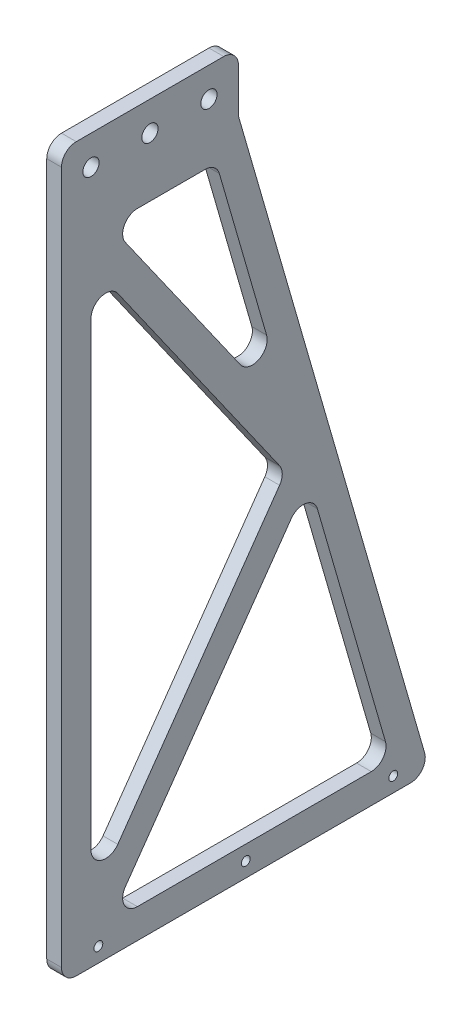
ISO-10303-21;
HEADER;
FILE_DESCRIPTION(('STEP AP214'),'2;1');
FILE_NAME('part.step','',(''),(''),'','','');
FILE_SCHEMA(('AUTOMOTIVE_DESIGN { 1 0 10303 214 1 1 1 1 }'));
ENDSEC;
DATA;
#1=APPLICATION_CONTEXT('core data for automotive mechanical design processes');
#2=APPLICATION_PROTOCOL_DEFINITION('international standard','automotive_design',2000,#1);
#3=PRODUCT_CONTEXT('',#1,'mechanical');
#4=PRODUCT('Part','Part','',(#3));
#5=PRODUCT_RELATED_PRODUCT_CATEGORY('part','',(#4));
#6=PRODUCT_DEFINITION_FORMATION('','',#4);
#7=PRODUCT_DEFINITION_CONTEXT('part definition',#1,'design');
#8=PRODUCT_DEFINITION('design','',#6,#7);
#9=PRODUCT_DEFINITION_SHAPE('','',#8);
#10=(LENGTH_UNIT() NAMED_UNIT(*) SI_UNIT(.MILLI.,.METRE.));
#11=(NAMED_UNIT(*) PLANE_ANGLE_UNIT() SI_UNIT($,.RADIAN.));
#12=(NAMED_UNIT(*) SI_UNIT($,.STERADIAN.) SOLID_ANGLE_UNIT());
#13=UNCERTAINTY_MEASURE_WITH_UNIT(LENGTH_MEASURE(1.E-05),#10,'distance_accuracy_value','');
#14=(GEOMETRIC_REPRESENTATION_CONTEXT(3) GLOBAL_UNCERTAINTY_ASSIGNED_CONTEXT((#13)) GLOBAL_UNIT_ASSIGNED_CONTEXT((#10,
#11,#12)) REPRESENTATION_CONTEXT('',''));
#15=CARTESIAN_POINT('',(0.,0.,0.));
#16=DIRECTION('',(0.,0.,1.));
#17=DIRECTION('',(1.,0.,0.));
#18=AXIS2_PLACEMENT_3D('',#15,#16,#17);
#19=CARTESIAN_POINT('',(5.,7.22880583409299,-25.0227894257065));
#20=DIRECTION('',(0.,0.277539652820775,-0.960714182841142));
#21=DIRECTION('',(0.,0.960714182841142,0.277539652820775));
#22=AXIS2_PLACEMENT_3D('',#19,#20,#21);
#23=PLANE('',#22);
#24=DIRECTION('',(0.,-0.960714182841142,-0.277539652820775));
#25=VECTOR('',#24,1.);
#26=CARTESIAN_POINT('',(0.,7.22880583409299,-25.0227894257065));
#27=LINE('',#26,#25);
#28=CARTESIAN_POINT('',(0.,-10.6799468354418,-30.1964290857943));
#29=VERTEX_POINT('',#28);
#30=CARTESIAN_POINT('',(0.,-228.612301735896,-93.1546649459256));
#31=VERTEX_POINT('',#30);
#32=EDGE_CURVE('E564',#29,#31,#27,.T.);
#33=ORIENTED_EDGE('',*,*,#32,.F.);
#34=DIRECTION('',(-1.,0.,0.));
#35=VECTOR('',#34,1.);
#36=CARTESIAN_POINT('',(5.,-10.6799468354418,-30.1964290857943));
#37=LINE('',#36,#35);
#38=CARTESIAN_POINT('',(5.,-10.6799468354418,-30.1964290857943));
#39=VERTEX_POINT('',#38);
#40=EDGE_CURVE('E311',#29,#39,#37,.F.);
#41=ORIENTED_EDGE('',*,*,#40,.T.);
#42=DIRECTION('',(0.,-0.960714182841142,-0.277539652820775));
#43=VECTOR('',#42,1.);
#44=CARTESIAN_POINT('',(5.,7.22880583409299,-25.0227894257065));
#45=LINE('',#44,#43);
#46=CARTESIAN_POINT('',(5.,-228.612301735896,-93.1546649459256));
#47=VERTEX_POINT('',#46);
#48=EDGE_CURVE('E507',#39,#47,#45,.T.);
#49=ORIENTED_EDGE('',*,*,#48,.T.);
#50=DIRECTION('',(-1.,0.,0.));
#51=VECTOR('',#50,1.);
#52=CARTESIAN_POINT('',(0.,-228.612301735896,-93.1546649459256));
#53=LINE('',#52,#51);
#54=EDGE_CURVE('E307',#47,#31,#53,.T.);
#55=ORIENTED_EDGE('',*,*,#54,.T.);
#56=EDGE_LOOP('',(#33,#41,#49,#55));
#57=FACE_BOUND('',#56,.T.);
#58=ADVANCED_FACE('F41',(#57),#23,.T.);
#59=CARTESIAN_POINT('',(5.,0.,-30.));
#60=DIRECTION('',(0.,0.,-1.));
#61=DIRECTION('',(-1.,0.,0.));
#62=AXIS2_PLACEMENT_3D('',#59,#60,#61);
#63=PLANE('',#62);
#64=DIRECTION('',(0.,-1.,0.));
#65=VECTOR('',#64,1.);
#66=CARTESIAN_POINT('',(0.,0.,-30.));
#67=LINE('',#66,#65);
#68=CARTESIAN_POINT('',(0.,5.,-30.));
#69=VERTEX_POINT('',#68);
#70=CARTESIAN_POINT('',(0.,-9.29224857133788,-30.));
#71=VERTEX_POINT('',#70);
#72=EDGE_CURVE('E567',#69,#71,#67,.T.);
#73=ORIENTED_EDGE('',*,*,#72,.F.);
#74=DIRECTION('',(-1.,0.,0.));
#75=VECTOR('',#74,1.);
#76=CARTESIAN_POINT('',(5.,5.,-30.));
#77=LINE('',#76,#75);
#78=CARTESIAN_POINT('',(5.,5.,-30.));
#79=VERTEX_POINT('',#78);
#80=EDGE_CURVE('E304',#69,#79,#77,.F.);
#81=ORIENTED_EDGE('',*,*,#80,.T.);
#82=DIRECTION('',(0.,-1.,0.));
#83=VECTOR('',#82,1.);
#84=CARTESIAN_POINT('',(5.,0.,-30.));
#85=LINE('',#84,#83);
#86=CARTESIAN_POINT('',(5.,-9.29224857133788,-30.));
#87=VERTEX_POINT('',#86);
#88=EDGE_CURVE('E511',#79,#87,#85,.T.);
#89=ORIENTED_EDGE('',*,*,#88,.T.);
#90=DIRECTION('',(-1.,0.,0.));
#91=VECTOR('',#90,1.);
#92=CARTESIAN_POINT('',(0.,-9.29224857133788,-30.));
#93=LINE('',#92,#91);
#94=EDGE_CURVE('E300',#87,#71,#93,.T.);
#95=ORIENTED_EDGE('',*,*,#94,.T.);
#96=EDGE_LOOP('',(#73,#81,#89,#95));
#97=FACE_BOUND('',#96,.T.);
#98=ADVANCED_FACE('F592',(#97),#63,.T.);
#99=CARTESIAN_POINT('',(5.,10.,0.));
#100=DIRECTION('',(0.,1.,0.));
#101=DIRECTION('',(0.,0.,1.));
#102=AXIS2_PLACEMENT_3D('',#99,#100,#101);
#103=PLANE('',#102);
#104=DIRECTION('',(0.,0.,-1.));
#105=VECTOR('',#104,1.);
#106=CARTESIAN_POINT('',(0.,10.,0.));
#107=LINE('',#106,#105);
#108=CARTESIAN_POINT('',(0.,10.,25.));
#109=VERTEX_POINT('',#108);
#110=CARTESIAN_POINT('',(0.,10.,-25.));
#111=VERTEX_POINT('',#110);
#112=EDGE_CURVE('E265',#109,#111,#107,.T.);
#113=ORIENTED_EDGE('',*,*,#112,.F.);
#114=DIRECTION('',(-1.,0.,0.));
#115=VECTOR('',#114,1.);
#116=CARTESIAN_POINT('',(5.,10.,25.));
#117=LINE('',#116,#115);
#118=CARTESIAN_POINT('',(5.,10.,25.));
#119=VERTEX_POINT('',#118);
#120=EDGE_CURVE('E64',#109,#119,#117,.F.);
#121=ORIENTED_EDGE('',*,*,#120,.T.);
#122=DIRECTION('',(0.,0.,-1.));
#123=VECTOR('',#122,1.);
#124=CARTESIAN_POINT('',(5.,10.,0.));
#125=LINE('',#124,#123);
#126=CARTESIAN_POINT('',(5.,10.,-25.));
#127=VERTEX_POINT('',#126);
#128=EDGE_CURVE('E515',#119,#127,#125,.T.);
#129=ORIENTED_EDGE('',*,*,#128,.T.);
#130=DIRECTION('',(-1.,0.,0.));
#131=VECTOR('',#130,1.);
#132=CARTESIAN_POINT('',(5.,10.,-25.));
#133=LINE('',#132,#131);
#134=EDGE_CURVE('E294',#127,#111,#133,.T.);
#135=ORIENTED_EDGE('',*,*,#134,.T.);
#136=EDGE_LOOP('',(#113,#121,#129,#135));
#137=FACE_BOUND('',#136,.T.);
#138=ADVANCED_FACE('F573',(#137),#103,.T.);
#139=CARTESIAN_POINT('',(5.,0.,30.));
#140=DIRECTION('',(0.,0.,-1.));
#141=DIRECTION('',(0.,1.,0.));
#142=AXIS2_PLACEMENT_3D('',#139,#140,#141);
#143=PLANE('',#142);
#144=DIRECTION('',(0.,-1.,0.));
#145=VECTOR('',#144,1.);
#146=CARTESIAN_POINT('',(0.,0.,30.));
#147=LINE('',#146,#145);
#148=CARTESIAN_POINT('',(0.,5.,30.));
#149=VERTEX_POINT('',#148);
#150=CARTESIAN_POINT('',(0.,-230.,30.));
#151=VERTEX_POINT('',#150);
#152=EDGE_CURVE('E258',#149,#151,#147,.T.);
#153=ORIENTED_EDGE('',*,*,#152,.T.);
#154=DIRECTION('',(-1.,0.,0.));
#155=VECTOR('',#154,1.);
#156=CARTESIAN_POINT('',(5.,-230.,30.));
#157=LINE('',#156,#155);
#158=CARTESIAN_POINT('',(5.,-230.,30.));
#159=VERTEX_POINT('',#158);
#160=EDGE_CURVE('E233',#151,#159,#157,.F.);
#161=ORIENTED_EDGE('',*,*,#160,.T.);
#162=DIRECTION('',(0.,-1.,0.));
#163=VECTOR('',#162,1.);
#164=CARTESIAN_POINT('',(5.,0.,30.));
#165=LINE('',#164,#163);
#166=CARTESIAN_POINT('',(5.,5.,30.));
#167=VERTEX_POINT('',#166);
#168=EDGE_CURVE('E518',#167,#159,#165,.T.);
#169=ORIENTED_EDGE('',*,*,#168,.F.);
#170=DIRECTION('',(-1.,0.,0.));
#171=VECTOR('',#170,1.);
#172=CARTESIAN_POINT('',(0.,5.,30.));
#173=LINE('',#172,#171);
#174=EDGE_CURVE('E239',#167,#149,#173,.T.);
#175=ORIENTED_EDGE('',*,*,#174,.T.);
#176=EDGE_LOOP('',(#153,#161,#169,#175));
#177=FACE_BOUND('',#176,.T.);
#178=ADVANCED_FACE('F581',(#177),#143,.F.);
#179=CARTESIAN_POINT('',(5.,0.,20.));
#180=DIRECTION('',(0.,0.,-1.));
#181=DIRECTION('',(-1.,0.,0.));
#182=AXIS2_PLACEMENT_3D('',#179,#180,#181);
#183=PLANE('',#182);
#184=DIRECTION('',(0.,-1.,0.));
#185=VECTOR('',#184,1.);
#186=CARTESIAN_POINT('',(5.,0.,20.));
#187=LINE('',#186,#185);
#188=CARTESIAN_POINT('',(5.,-44.4916720402801,20.));
#189=VERTEX_POINT('',#188);
#190=CARTESIAN_POINT('',(5.,-200.50832795972,20.));
#191=VERTEX_POINT('',#190);
#192=EDGE_CURVE('E481',#189,#191,#187,.T.);
#193=ORIENTED_EDGE('',*,*,#192,.T.);
#194=DIRECTION('',(-1.,0.,0.));
#195=VECTOR('',#194,1.);
#196=CARTESIAN_POINT('',(0.,-200.50832795972,20.));
#197=LINE('',#196,#195);
#198=CARTESIAN_POINT('',(0.,-200.50832795972,20.));
#199=VERTEX_POINT('',#198);
#200=EDGE_CURVE('E317',#191,#199,#197,.T.);
#201=ORIENTED_EDGE('',*,*,#200,.T.);
#202=DIRECTION('',(0.,-1.,0.));
#203=VECTOR('',#202,1.);
#204=CARTESIAN_POINT('',(0.,0.,20.));
#205=LINE('',#204,#203);
#206=CARTESIAN_POINT('',(0.,-44.4916720402801,20.));
#207=VERTEX_POINT('',#206);
#208=EDGE_CURVE('E540',#207,#199,#205,.T.);
#209=ORIENTED_EDGE('',*,*,#208,.F.);
#210=DIRECTION('',(-1.,0.,0.));
#211=VECTOR('',#210,1.);
#212=CARTESIAN_POINT('',(5.,-44.4916720402801,20.));
#213=LINE('',#212,#211);
#214=EDGE_CURVE('E314',#207,#189,#213,.F.);
#215=ORIENTED_EDGE('',*,*,#214,.T.);
#216=EDGE_LOOP('',(#193,#201,#209,#215));
#217=FACE_BOUND('',#216,.T.);
#218=ADVANCED_FACE('F583',(#217),#183,.T.);
#219=CARTESIAN_POINT('',(5.,-18.9066992381323,26.8817827924815));
#220=DIRECTION('',(0.,-0.575287628839116,0.817951186871605));
#221=DIRECTION('',(0.,-0.817951186871605,-0.575287628839116));
#222=AXIS2_PLACEMENT_3D('',#219,#220,#221);
#223=PLANE('',#222);
#224=DIRECTION('',(0.,0.817951186871605,0.575287628839116));
#225=VECTOR('',#224,1.);
#226=CARTESIAN_POINT('',(0.,-18.9066992381323,26.8817827924815));
#227=LINE('',#226,#225);
#228=CARTESIAN_POINT('',(0.,-119.623561855804,-43.9551644598863));
#229=VERTEX_POINT('',#228);
#230=CARTESIAN_POINT('',(0.,-41.6152338960846,10.910244065642));
#231=VERTEX_POINT('',#230);
#232=EDGE_CURVE('E544',#229,#231,#227,.T.);
#233=ORIENTED_EDGE('',*,*,#232,.F.);
#234=DIRECTION('',(-1.,0.,0.));
#235=VECTOR('',#234,1.);
#236=CARTESIAN_POINT('',(5.,-119.623561855804,-43.9551644598863));
#237=LINE('',#236,#235);
#238=CARTESIAN_POINT('',(5.,-119.623561855804,-43.9551644598863));
#239=VERTEX_POINT('',#238);
#240=EDGE_CURVE('E332',#229,#239,#237,.F.);
#241=ORIENTED_EDGE('',*,*,#240,.T.);
#242=DIRECTION('',(0.,0.817951186871605,0.575287628839116));
#243=VECTOR('',#242,1.);
#244=CARTESIAN_POINT('',(5.,-18.9066992381323,26.8817827924815));
#245=LINE('',#244,#243);
#246=CARTESIAN_POINT('',(5.,-41.6152338960846,10.910244065642));
#247=VERTEX_POINT('',#246);
#248=EDGE_CURVE('E487',#239,#247,#245,.T.);
#249=ORIENTED_EDGE('',*,*,#248,.T.);
#250=DIRECTION('',(-1.,0.,0.));
#251=VECTOR('',#250,1.);
#252=CARTESIAN_POINT('',(0.,-41.6152338960845,10.910244065642));
#253=LINE('',#252,#251);
#254=EDGE_CURVE('E328',#247,#231,#253,.T.);
#255=ORIENTED_EDGE('',*,*,#254,.T.);
#256=EDGE_LOOP('',(#233,#241,#249,#255));
#257=FACE_BOUND('',#256,.T.);
#258=ADVANCED_FACE('F589',(#257),#223,.T.);
#259=CARTESIAN_POINT('',(5.,4.45340930588524,-15.4156475972951));
#260=DIRECTION('',(0.,0.277539652820775,-0.960714182841142));
#261=DIRECTION('',(0.,0.960714182841142,0.277539652820775));
#262=AXIS2_PLACEMENT_3D('',#259,#260,#261);
#263=PLANE('',#262);
#264=DIRECTION('',(0.,-0.960714182841142,-0.277539652820775));
#265=VECTOR('',#264,1.);
#266=CARTESIAN_POINT('',(5.,4.45340930588524,-15.4156475972951));
#267=LINE('',#266,#265);
#268=CARTESIAN_POINT('',(5.,-23.6123017358961,-23.5235196760319));
#269=VERTEX_POINT('',#268);
#270=CARTESIAN_POINT('',(5.,-79.0551040766952,-39.5403292411516));
#271=VERTEX_POINT('',#270);
#272=EDGE_CURVE('E464',#269,#271,#267,.T.);
#273=ORIENTED_EDGE('',*,*,#272,.F.);
#274=DIRECTION('',(-1.,0.,0.));
#275=VECTOR('',#274,1.);
#276=CARTESIAN_POINT('',(0.,-23.6123017358961,-23.5235196760319));
#277=LINE('',#276,#275);
#278=CARTESIAN_POINT('',(0.,-23.6123017358961,-23.5235196760319));
#279=VERTEX_POINT('',#278);
#280=EDGE_CURVE('E338',#269,#279,#277,.T.);
#281=ORIENTED_EDGE('',*,*,#280,.T.);
#282=DIRECTION('',(0.,-0.960714182841142,-0.277539652820775));
#283=VECTOR('',#282,1.);
#284=CARTESIAN_POINT('',(0.,4.45340930588524,-15.4156475972951));
#285=LINE('',#284,#283);
#286=CARTESIAN_POINT('',(0.,-79.0551040766952,-39.5403292411516));
#287=VERTEX_POINT('',#286);
#288=EDGE_CURVE('E524',#279,#287,#285,.T.);
#289=ORIENTED_EDGE('',*,*,#288,.T.);
#290=DIRECTION('',(-1.,0.,0.));
#291=VECTOR('',#290,1.);
#292=CARTESIAN_POINT('',(5.,-79.0551040766951,-39.5403292411516));
#293=LINE('',#292,#291);
#294=EDGE_CURVE('E335',#287,#271,#293,.F.);
#295=ORIENTED_EDGE('',*,*,#294,.T.);
#296=EDGE_LOOP('',(#273,#281,#289,#295));
#297=FACE_BOUND('',#296,.T.);
#298=ADVANCED_FACE('F623',(#297),#263,.F.);
#299=CARTESIAN_POINT('',(5.,-13.1538229497412,18.7022709237655));
#300=DIRECTION('',(0.,-0.575287628839116,0.817951186871605));
#301=DIRECTION('',(0.,-0.817951186871605,-0.575287628839116));
#302=AXIS2_PLACEMENT_3D('',#299,#300,#301);
#303=PLANE('',#302);
#304=DIRECTION('',(0.,0.817951186871605,0.575287628839116));
#305=VECTOR('',#304,1.);
#306=CARTESIAN_POINT('',(0.,-13.1538229497412,18.7022709237655));
#307=LINE('',#306,#305);
#308=CARTESIAN_POINT('',(0.,-83.3192404849946,-30.6470023925879));
#309=VERTEX_POINT('',#308);
#310=CARTESIAN_POINT('',(0.,-27.8764381441956,8.34744960744415));
#311=VERTEX_POINT('',#310);
#312=EDGE_CURVE('E528',#309,#311,#307,.T.);
#313=ORIENTED_EDGE('',*,*,#312,.T.);
#314=DIRECTION('',(-1.,0.,0.));
#315=VECTOR('',#314,1.);
#316=CARTESIAN_POINT('',(5.,-27.8764381441956,8.34744960744416));
#317=LINE('',#316,#315);
#318=CARTESIAN_POINT('',(5.,-27.8764381441956,8.34744960744415));
#319=VERTEX_POINT('',#318);
#320=EDGE_CURVE('E353',#311,#319,#317,.F.);
#321=ORIENTED_EDGE('',*,*,#320,.T.);
#322=DIRECTION('',(0.,0.817951186871605,0.575287628839116));
#323=VECTOR('',#322,1.);
#324=CARTESIAN_POINT('',(5.,-13.1538229497412,18.7022709237655));
#325=LINE('',#324,#323);
#326=CARTESIAN_POINT('',(5.,-83.3192404849946,-30.6470023925879));
#327=VERTEX_POINT('',#326);
#328=EDGE_CURVE('E470',#327,#319,#325,.T.);
#329=ORIENTED_EDGE('',*,*,#328,.F.);
#330=DIRECTION('',(-1.,0.,0.));
#331=VECTOR('',#330,1.);
#332=CARTESIAN_POINT('',(0.,-83.3192404849946,-30.6470023925879));
#333=LINE('',#332,#331);
#334=EDGE_CURVE('E349',#327,#309,#333,.T.);
#335=ORIENTED_EDGE('',*,*,#334,.T.);
#336=EDGE_LOOP('',(#313,#321,#329,#335));
#337=FACE_BOUND('',#336,.T.);
#338=ADVANCED_FACE('F630',(#337),#303,.F.);
#339=CARTESIAN_POINT('',(5.,-67.9303617446153,-96.5842427826036));
#340=DIRECTION('',(0.,0.575287628839116,0.817951186871605));
#341=DIRECTION('',(0.,-0.817951186871605,0.575287628839116));
#342=AXIS2_PLACEMENT_3D('',#339,#340,#341);
#343=PLANE('',#342);
#344=DIRECTION('',(0.,0.817951186871605,-0.575287628839116));
#345=VECTOR('',#344,1.);
#346=CARTESIAN_POINT('',(5.,-67.9303617446153,-96.5842427826036));
#347=LINE('',#346,#345);
#348=CARTESIAN_POINT('',(5.,-217.123561855804,8.34744960744413));
#349=VERTEX_POINT('',#348);
#350=CARTESIAN_POINT('',(5.,-137.190424024254,-47.8717307872425));
#351=VERTEX_POINT('',#350);
#352=EDGE_CURVE('E257',#349,#351,#347,.T.);
#353=ORIENTED_EDGE('',*,*,#352,.F.);
#354=DIRECTION('',(-1.,0.,0.));
#355=VECTOR('',#354,1.);
#356=CARTESIAN_POINT('',(5.,-217.123561855804,8.34744960744413));
#357=LINE('',#356,#355);
#358=CARTESIAN_POINT('',(0.,-217.123561855804,8.34744960744413));
#359=VERTEX_POINT('',#358);
#360=EDGE_CURVE('E359',#349,#359,#357,.T.);
#361=ORIENTED_EDGE('',*,*,#360,.T.);
#362=DIRECTION('',(0.,0.817951186871605,-0.575287628839116));
#363=VECTOR('',#362,1.);
#364=CARTESIAN_POINT('',(0.,-67.9303617446153,-96.5842427826036));
#365=LINE('',#364,#363);
#366=CARTESIAN_POINT('',(0.,-137.190424024254,-47.8717307872425));
#367=VERTEX_POINT('',#366);
#368=EDGE_CURVE('E436',#359,#367,#365,.T.);
#369=ORIENTED_EDGE('',*,*,#368,.T.);
#370=DIRECTION('',(-1.,0.,0.));
#371=VECTOR('',#370,1.);
#372=CARTESIAN_POINT('',(5.,-137.190424024254,-47.8717307872425));
#373=LINE('',#372,#371);
#374=EDGE_CURVE('E356',#367,#351,#373,.F.);
#375=ORIENTED_EDGE('',*,*,#374,.T.);
#376=EDGE_LOOP('',(#353,#361,#369,#375));
#377=FACE_BOUND('',#376,.T.);
#378=ADVANCED_FACE('F444',(#377),#343,.F.);
#379=CARTESIAN_POINT('',(0.,-138.679163904346,-56.7650576358063));
#380=VERTEX_POINT('',#379);
#381=CARTESIAN_POINT('',(0.,-218.612301735896,-79.8568530093652));
#382=VERTEX_POINT('',#381);
#383=EDGE_CURVE('E438',#380,#382,#285,.T.);
#384=ORIENTED_EDGE('',*,*,#383,.T.);
#385=DIRECTION('',(-1.,0.,0.));
#386=VECTOR('',#385,1.);
#387=CARTESIAN_POINT('',(5.,-218.612301735896,-79.8568530093652));
#388=LINE('',#387,#386);
#389=CARTESIAN_POINT('',(5.,-218.612301735896,-79.8568530093652));
#390=VERTEX_POINT('',#389);
#391=EDGE_CURVE('E374',#382,#390,#388,.F.);
#392=ORIENTED_EDGE('',*,*,#391,.T.);
#393=CARTESIAN_POINT('',(5.,-138.679163904346,-56.7650576358063));
#394=VERTEX_POINT('',#393);
#395=EDGE_CURVE('E263',#394,#390,#267,.T.);
#396=ORIENTED_EDGE('',*,*,#395,.F.);
#397=DIRECTION('',(-1.,0.,0.));
#398=VECTOR('',#397,1.);
#399=CARTESIAN_POINT('',(0.,-138.679163904346,-56.7650576358063));
#400=LINE('',#399,#398);
#401=EDGE_CURVE('E370',#394,#380,#400,.T.);
#402=ORIENTED_EDGE('',*,*,#401,.T.);
#403=EDGE_LOOP('',(#384,#392,#396,#402));
#404=FACE_BOUND('',#403,.T.);
#405=ADVANCED_FACE('F459',(#404),#263,.F.);
#406=CARTESIAN_POINT('',(5.,-230.,-82.5));
#407=DIRECTION('',(-1.,0.,0.));
#408=DIRECTION('',(0.,0.,1.));
#409=AXIS2_PLACEMENT_3D('',#406,#407,#408);
#410=CYLINDRICAL_SURFACE('',#409,1.5);
#411=CARTESIAN_POINT('',(5.,-230.,-82.5));
#412=DIRECTION('',(1.,0.,0.));
#413=DIRECTION('',(0.,0.,-1.));
#414=AXIS2_PLACEMENT_3D('',#411,#412,#413);
#415=CIRCLE('',#414,1.5);
#416=CARTESIAN_POINT('',(5.,-230.,-84.));
#417=VERTEX_POINT('',#416);
#418=EDGE_CURVE('E503',#417,#417,#415,.T.);
#419=ORIENTED_EDGE('',*,*,#418,.T.);
#420=EDGE_LOOP('',(#419));
#421=FACE_BOUND('',#420,.T.);
#422=CARTESIAN_POINT('',(0.,-230.,-82.5));
#423=DIRECTION('',(1.,0.,0.));
#424=DIRECTION('',(0.,0.,-1.));
#425=AXIS2_PLACEMENT_3D('',#422,#423,#424);
#426=CIRCLE('',#425,1.5);
#427=CARTESIAN_POINT('',(0.,-230.,-84.));
#428=VERTEX_POINT('',#427);
#429=EDGE_CURVE('E560',#428,#428,#426,.T.);
#430=ORIENTED_EDGE('',*,*,#429,.F.);
#431=EDGE_LOOP('',(#430));
#432=FACE_BOUND('',#431,.T.);
#433=ADVANCED_FACE('F605',(#421,#432),#410,.F.);
#434=CARTESIAN_POINT('',(5.,-230.,17.5));
#435=DIRECTION('',(-1.,0.,0.));
#436=DIRECTION('',(0.,0.,1.));
#437=AXIS2_PLACEMENT_3D('',#434,#435,#436);
#438=CYLINDRICAL_SURFACE('',#437,1.5);
#439=CARTESIAN_POINT('',(5.,-230.,17.5));
#440=DIRECTION('',(1.,0.,0.));
#441=DIRECTION('',(0.,0.,-1.));
#442=AXIS2_PLACEMENT_3D('',#439,#440,#441);
#443=CIRCLE('',#442,1.5);
#444=CARTESIAN_POINT('',(5.,-230.,16.));
#445=VERTEX_POINT('',#444);
#446=EDGE_CURVE('E499',#445,#445,#443,.T.);
#447=ORIENTED_EDGE('',*,*,#446,.T.);
#448=EDGE_LOOP('',(#447));
#449=FACE_BOUND('',#448,.T.);
#450=CARTESIAN_POINT('',(0.,-230.,17.5));
#451=DIRECTION('',(1.,0.,0.));
#452=DIRECTION('',(0.,0.,-1.));
#453=AXIS2_PLACEMENT_3D('',#450,#451,#452);
#454=CIRCLE('',#453,1.5);
#455=CARTESIAN_POINT('',(0.,-230.,16.));
#456=VERTEX_POINT('',#455);
#457=EDGE_CURVE('E556',#456,#456,#454,.T.);
#458=ORIENTED_EDGE('',*,*,#457,.F.);
#459=EDGE_LOOP('',(#458));
#460=FACE_BOUND('',#459,.T.);
#461=ADVANCED_FACE('F608',(#449,#460),#438,.F.);
#462=CARTESIAN_POINT('',(5.,-230.,-32.5));
#463=DIRECTION('',(-1.,0.,0.));
#464=DIRECTION('',(0.,0.,1.));
#465=AXIS2_PLACEMENT_3D('',#462,#463,#464);
#466=CYLINDRICAL_SURFACE('',#465,1.5);
#467=CARTESIAN_POINT('',(5.,-230.,-32.5));
#468=DIRECTION('',(1.,0.,0.));
#469=DIRECTION('',(0.,0.,-1.));
#470=AXIS2_PLACEMENT_3D('',#467,#468,#469);
#471=CIRCLE('',#470,1.5);
#472=CARTESIAN_POINT('',(5.,-230.,-34.));
#473=VERTEX_POINT('',#472);
#474=EDGE_CURVE('E495',#473,#473,#471,.T.);
#475=ORIENTED_EDGE('',*,*,#474,.T.);
#476=EDGE_LOOP('',(#475));
#477=FACE_BOUND('',#476,.T.);
#478=CARTESIAN_POINT('',(0.,-230.,-32.5));
#479=DIRECTION('',(1.,0.,0.));
#480=DIRECTION('',(0.,0.,-1.));
#481=AXIS2_PLACEMENT_3D('',#478,#479,#480);
#482=CIRCLE('',#481,1.5);
#483=CARTESIAN_POINT('',(0.,-230.,-34.));
#484=VERTEX_POINT('',#483);
#485=EDGE_CURVE('E552',#484,#484,#482,.T.);
#486=ORIENTED_EDGE('',*,*,#485,.F.);
#487=EDGE_LOOP('',(#486));
#488=FACE_BOUND('',#487,.T.);
#489=ADVANCED_FACE('F612',(#477,#488),#466,.F.);
#490=CARTESIAN_POINT('',(5.,-62.1774854562241,-88.4047309138876));
#491=DIRECTION('',(0.,0.575287628839116,0.817951186871605));
#492=DIRECTION('',(0.,-0.817951186871605,0.575287628839116));
#493=AXIS2_PLACEMENT_3D('',#490,#491,#492);
#494=PLANE('',#493);
#495=DIRECTION('',(0.,0.817951186871605,-0.575287628839116));
#496=VECTOR('',#495,1.);
#497=CARTESIAN_POINT('',(0.,-62.1774854562241,-88.4047309138876));
#498=LINE('',#497,#496);
#499=CARTESIAN_POINT('',(0.,-203.384766103915,10.910244065642));
#500=VERTEX_POINT('',#499);
#501=CARTESIAN_POINT('',(0.,-125.376438144196,-43.9551644598863));
#502=VERTEX_POINT('',#501);
#503=EDGE_CURVE('E548',#500,#502,#498,.T.);
#504=ORIENTED_EDGE('',*,*,#503,.F.);
#505=DIRECTION('',(-1.,0.,0.));
#506=VECTOR('',#505,1.);
#507=CARTESIAN_POINT('',(5.,-203.384766103915,10.910244065642));
#508=LINE('',#507,#506);
#509=CARTESIAN_POINT('',(5.,-203.384766103915,10.910244065642));
#510=VERTEX_POINT('',#509);
#511=EDGE_CURVE('E325',#500,#510,#508,.F.);
#512=ORIENTED_EDGE('',*,*,#511,.T.);
#513=DIRECTION('',(0.,0.817951186871605,-0.575287628839116));
#514=VECTOR('',#513,1.);
#515=CARTESIAN_POINT('',(5.,-62.1774854562241,-88.4047309138876));
#516=LINE('',#515,#514);
#517=CARTESIAN_POINT('',(5.,-125.376438144196,-43.9551644598863));
#518=VERTEX_POINT('',#517);
#519=EDGE_CURVE('E491',#510,#518,#516,.T.);
#520=ORIENTED_EDGE('',*,*,#519,.T.);
#521=DIRECTION('',(-1.,0.,0.));
#522=VECTOR('',#521,1.);
#523=CARTESIAN_POINT('',(0.,-125.376438144196,-43.9551644598863));
#524=LINE('',#523,#522);
#525=EDGE_CURVE('E321',#518,#502,#524,.T.);
#526=ORIENTED_EDGE('',*,*,#525,.T.);
#527=EDGE_LOOP('',(#504,#512,#520,#526));
#528=FACE_BOUND('',#527,.T.);
#529=ADVANCED_FACE('F616',(#528),#494,.T.);
#530=CARTESIAN_POINT('',(5.,-20.,0.));
#531=DIRECTION('',(0.,1.,0.));
#532=DIRECTION('',(0.,0.,1.));
#533=AXIS2_PLACEMENT_3D('',#530,#531,#532);
#534=PLANE('',#533);
#535=DIRECTION('',(0.,0.,-1.));
#536=VECTOR('',#535,1.);
#537=CARTESIAN_POINT('',(0.,-20.,0.));
#538=LINE('',#537,#536);
#539=CARTESIAN_POINT('',(0.,-20.,4.25769367308613));
#540=VERTEX_POINT('',#539);
#541=CARTESIAN_POINT('',(0.,-20.,-18.7199487618262));
#542=VERTEX_POINT('',#541);
#543=EDGE_CURVE('E536',#540,#542,#538,.T.);
#544=ORIENTED_EDGE('',*,*,#543,.T.);
#545=DIRECTION('',(-1.,0.,0.));
#546=VECTOR('',#545,1.);
#547=CARTESIAN_POINT('',(5.,-20.,-18.7199487618262));
#548=LINE('',#547,#546);
#549=CARTESIAN_POINT('',(5.,-20.,-18.7199487618262));
#550=VERTEX_POINT('',#549);
#551=EDGE_CURVE('E346',#542,#550,#548,.F.);
#552=ORIENTED_EDGE('',*,*,#551,.T.);
#553=DIRECTION('',(0.,0.,-1.));
#554=VECTOR('',#553,1.);
#555=CARTESIAN_POINT('',(5.,-20.,0.));
#556=LINE('',#555,#554);
#557=CARTESIAN_POINT('',(5.,-20.,4.25769367308613));
#558=VERTEX_POINT('',#557);
#559=EDGE_CURVE('E475',#558,#550,#556,.T.);
#560=ORIENTED_EDGE('',*,*,#559,.F.);
#561=DIRECTION('',(-1.,0.,0.));
#562=VECTOR('',#561,1.);
#563=CARTESIAN_POINT('',(0.,-20.,4.25769367308613));
#564=LINE('',#563,#562);
#565=EDGE_CURVE('E342',#558,#540,#564,.T.);
#566=ORIENTED_EDGE('',*,*,#565,.T.);
#567=EDGE_LOOP('',(#544,#552,#560,#566));
#568=FACE_BOUND('',#567,.T.);
#569=ADVANCED_FACE('F620',(#568),#534,.F.);
#570=CARTESIAN_POINT('',(5.,-225.,0.));
#571=DIRECTION('',(0.,1.,0.));
#572=DIRECTION('',(0.,0.,1.));
#573=AXIS2_PLACEMENT_3D('',#570,#571,#572);
#574=PLANE('',#573);
#575=DIRECTION('',(0.,0.,-1.));
#576=VECTOR('',#575,1.);
#577=CARTESIAN_POINT('',(0.,-225.,0.));
#578=LINE('',#577,#576);
#579=CARTESIAN_POINT('',(0.,-225.,4.25769367308609));
#580=VERTEX_POINT('',#579);
#581=CARTESIAN_POINT('',(0.,-225.,-75.0532820951595));
#582=VERTEX_POINT('',#581);
#583=EDGE_CURVE('E529',#580,#582,#578,.T.);
#584=ORIENTED_EDGE('',*,*,#583,.F.);
#585=DIRECTION('',(-1.,0.,0.));
#586=VECTOR('',#585,1.);
#587=CARTESIAN_POINT('',(5.,-225.,4.25769367308609));
#588=LINE('',#587,#586);
#589=CARTESIAN_POINT('',(5.,-225.,4.25769367308609));
#590=VERTEX_POINT('',#589);
#591=EDGE_CURVE('E367',#580,#590,#588,.F.);
#592=ORIENTED_EDGE('',*,*,#591,.T.);
#593=DIRECTION('',(0.,0.,-1.));
#594=VECTOR('',#593,1.);
#595=CARTESIAN_POINT('',(5.,-225.,0.));
#596=LINE('',#595,#594);
#597=CARTESIAN_POINT('',(5.,-225.,-75.0532820951595));
#598=VERTEX_POINT('',#597);
#599=EDGE_CURVE('E462',#590,#598,#596,.T.);
#600=ORIENTED_EDGE('',*,*,#599,.T.);
#601=DIRECTION('',(-1.,0.,0.));
#602=VECTOR('',#601,1.);
#603=CARTESIAN_POINT('',(5.,-225.,-75.0532820951595));
#604=LINE('',#603,#602);
#605=EDGE_CURVE('E363',#598,#582,#604,.T.);
#606=ORIENTED_EDGE('',*,*,#605,.T.);
#607=EDGE_LOOP('',(#584,#592,#600,#606));
#608=FACE_BOUND('',#607,.T.);
#609=ADVANCED_FACE('F628',(#608),#574,.T.);
#610=CARTESIAN_POINT('',(5.,-235.,0.));
#611=DIRECTION('',(0.,1.,0.));
#612=DIRECTION('',(0.,0.,1.));
#613=AXIS2_PLACEMENT_3D('',#610,#611,#612);
#614=PLANE('',#613);
#615=DIRECTION('',(0.,0.,-1.));
#616=VECTOR('',#615,1.);
#617=CARTESIAN_POINT('',(5.,-235.,0.));
#618=LINE('',#617,#616);
#619=CARTESIAN_POINT('',(5.,-235.,25.));
#620=VERTEX_POINT('',#619);
#621=CARTESIAN_POINT('',(5.,-235.,-88.3510940317199));
#622=VERTEX_POINT('',#621);
#623=EDGE_CURVE('E249',#620,#622,#618,.T.);
#624=ORIENTED_EDGE('',*,*,#623,.F.);
#625=DIRECTION('',(-1.,0.,0.));
#626=VECTOR('',#625,1.);
#627=CARTESIAN_POINT('',(5.,-235.,25.));
#628=LINE('',#627,#626);
#629=CARTESIAN_POINT('',(0.,-235.,25.));
#630=VERTEX_POINT('',#629);
#631=EDGE_CURVE('E232',#620,#630,#628,.T.);
#632=ORIENTED_EDGE('',*,*,#631,.T.);
#633=DIRECTION('',(0.,0.,-1.));
#634=VECTOR('',#633,1.);
#635=CARTESIAN_POINT('',(0.,-235.,0.));
#636=LINE('',#635,#634);
#637=CARTESIAN_POINT('',(0.,-235.,-88.3510940317199));
#638=VERTEX_POINT('',#637);
#639=EDGE_CURVE('E246',#630,#638,#636,.T.);
#640=ORIENTED_EDGE('',*,*,#639,.T.);
#641=DIRECTION('',(-1.,0.,0.));
#642=VECTOR('',#641,1.);
#643=CARTESIAN_POINT('',(5.,-235.,-88.3510940317199));
#644=LINE('',#643,#642);
#645=EDGE_CURVE('E252',#638,#622,#644,.F.);
#646=ORIENTED_EDGE('',*,*,#645,.T.);
#647=EDGE_LOOP('',(#624,#632,#640,#646));
#648=FACE_BOUND('',#647,.T.);
#649=ADVANCED_FACE('F245',(#648),#614,.F.);
#650=CARTESIAN_POINT('',(5.,0.,0.));
#651=DIRECTION('',(1.,0.,0.));
#652=DIRECTION('',(0.,0.,-1.));
#653=AXIS2_PLACEMENT_3D('',#650,#651,#652);
#654=PLANE('',#653);
#655=CARTESIAN_POINT('',(5.,0.,0.));
#656=DIRECTION('',(1.,0.,0.));
#657=DIRECTION('',(0.,0.,-1.));
#658=AXIS2_PLACEMENT_3D('',#655,#656,#657);
#659=CIRCLE('',#658,2.75);
#660=CARTESIAN_POINT('',(5.,0.,-2.75));
#661=VERTEX_POINT('',#660);
#662=EDGE_CURVE('E956',#661,#661,#659,.T.);
#663=ORIENTED_EDGE('',*,*,#662,.F.);
#664=EDGE_LOOP('',(#663));
#665=FACE_BOUND('',#664,.T.);
#666=CARTESIAN_POINT('',(5.,0.,-20.));
#667=DIRECTION('',(1.,0.,0.));
#668=DIRECTION('',(0.,0.,-1.));
#669=AXIS2_PLACEMENT_3D('',#666,#667,#668);
#670=CIRCLE('',#669,2.75);
#671=CARTESIAN_POINT('',(5.,0.,-22.75));
#672=VERTEX_POINT('',#671);
#673=EDGE_CURVE('E946',#672,#672,#670,.T.);
#674=ORIENTED_EDGE('',*,*,#673,.F.);
#675=EDGE_LOOP('',(#674));
#676=FACE_BOUND('',#675,.T.);
#677=CARTESIAN_POINT('',(5.,0.,20.));
#678=DIRECTION('',(1.,0.,0.));
#679=DIRECTION('',(0.,0.,-1.));
#680=AXIS2_PLACEMENT_3D('',#677,#678,#679);
#681=CIRCLE('',#680,2.75);
#682=CARTESIAN_POINT('',(5.,0.,17.25));
#683=VERTEX_POINT('',#682);
#684=EDGE_CURVE('E937',#683,#683,#681,.T.);
#685=ORIENTED_EDGE('',*,*,#684,.F.);
#686=EDGE_LOOP('',(#685));
#687=FACE_BOUND('',#686,.T.);
#688=ORIENTED_EDGE('',*,*,#599,.F.);
#689=CARTESIAN_POINT('',(5.,-220.,4.25769367308609));
#690=DIRECTION('',(1.,0.,0.));
#691=DIRECTION('',(0.,0.,-1.));
#692=AXIS2_PLACEMENT_3D('',#689,#690,#691);
#693=CIRCLE('',#692,5.);
#694=EDGE_CURVE('E422',#590,#349,#693,.F.);
#695=ORIENTED_EDGE('',*,*,#694,.T.);
#696=ORIENTED_EDGE('',*,*,#352,.T.);
#697=CARTESIAN_POINT('',(5.,-140.06686216845,-51.9614867216006));
#698=DIRECTION('',(1.,0.,0.));
#699=DIRECTION('',(0.,0.,-1.));
#700=AXIS2_PLACEMENT_3D('',#697,#698,#699);
#701=CIRCLE('',#700,5.);
#702=EDGE_CURVE('E11',#351,#394,#701,.F.);
#703=ORIENTED_EDGE('',*,*,#702,.T.);
#704=ORIENTED_EDGE('',*,*,#395,.T.);
#705=CARTESIAN_POINT('',(5.,-220.,-75.0532820951595));
#706=DIRECTION('',(1.,0.,0.));
#707=DIRECTION('',(0.,0.,-1.));
#708=AXIS2_PLACEMENT_3D('',#705,#706,#707);
#709=CIRCLE('',#708,5.);
#710=EDGE_CURVE('E428',#390,#598,#709,.F.);
#711=ORIENTED_EDGE('',*,*,#710,.T.);
#712=EDGE_LOOP('',(#688,#695,#696,#703,#704,#711));
#713=FACE_BOUND('',#712,.T.);
#714=ORIENTED_EDGE('',*,*,#559,.T.);
#715=CARTESIAN_POINT('',(5.,-25.,-18.7199487618262));
#716=DIRECTION('',(1.,0.,0.));
#717=DIRECTION('',(0.,0.,-1.));
#718=AXIS2_PLACEMENT_3D('',#715,#716,#717);
#719=CIRCLE('',#718,5.);
#720=EDGE_CURVE('E404',#550,#269,#719,.F.);
#721=ORIENTED_EDGE('',*,*,#720,.T.);
#722=ORIENTED_EDGE('',*,*,#272,.T.);
#723=CARTESIAN_POINT('',(5.,-80.442802340799,-34.7367583269459));
#724=DIRECTION('',(1.,0.,0.));
#725=DIRECTION('',(0.,0.,-1.));
#726=AXIS2_PLACEMENT_3D('',#723,#724,#725);
#727=CIRCLE('',#726,5.);
#728=EDGE_CURVE('E416',#271,#327,#727,.F.);
#729=ORIENTED_EDGE('',*,*,#728,.T.);
#730=ORIENTED_EDGE('',*,*,#328,.T.);
#731=CARTESIAN_POINT('',(5.,-25.,4.25769367308613));
#732=DIRECTION('',(1.,0.,0.));
#733=DIRECTION('',(0.,0.,-1.));
#734=AXIS2_PLACEMENT_3D('',#731,#732,#733);
#735=CIRCLE('',#734,5.);
#736=EDGE_CURVE('E410',#319,#558,#735,.F.);
#737=ORIENTED_EDGE('',*,*,#736,.T.);
#738=EDGE_LOOP('',(#714,#721,#722,#729,#730,#737));
#739=FACE_BOUND('',#738,.T.);
#740=ORIENTED_EDGE('',*,*,#192,.F.);
#741=CARTESIAN_POINT('',(5.,-44.4916720402801,15.));
#742=DIRECTION('',(1.,0.,0.));
#743=DIRECTION('',(0.,0.,-1.));
#744=AXIS2_PLACEMENT_3D('',#741,#742,#743);
#745=CIRCLE('',#744,5.);
#746=EDGE_CURVE('E398',#189,#247,#745,.F.);
#747=ORIENTED_EDGE('',*,*,#746,.T.);
#748=ORIENTED_EDGE('',*,*,#248,.F.);
#749=CARTESIAN_POINT('',(5.,-122.5,-39.8654085255283));
#750=DIRECTION('',(1.,0.,0.));
#751=DIRECTION('',(0.,0.,-1.));
#752=AXIS2_PLACEMENT_3D('',#749,#750,#751);
#753=CIRCLE('',#752,5.);
#754=EDGE_CURVE('E392',#239,#518,#753,.F.);
#755=ORIENTED_EDGE('',*,*,#754,.T.);
#756=ORIENTED_EDGE('',*,*,#519,.F.);
#757=CARTESIAN_POINT('',(5.,-200.50832795972,15.));
#758=DIRECTION('',(1.,0.,0.));
#759=DIRECTION('',(0.,0.,-1.));
#760=AXIS2_PLACEMENT_3D('',#757,#758,#759);
#761=CIRCLE('',#760,5.);
#762=EDGE_CURVE('E386',#510,#191,#761,.F.);
#763=ORIENTED_EDGE('',*,*,#762,.T.);
#764=EDGE_LOOP('',(#740,#747,#748,#755,#756,#763));
#765=FACE_BOUND('',#764,.T.);
#766=ORIENTED_EDGE('',*,*,#474,.F.);
#767=EDGE_LOOP('',(#766));
#768=FACE_BOUND('',#767,.T.);
#769=ORIENTED_EDGE('',*,*,#446,.F.);
#770=EDGE_LOOP('',(#769));
#771=FACE_BOUND('',#770,.T.);
#772=ORIENTED_EDGE('',*,*,#418,.F.);
#773=EDGE_LOOP('',(#772));
#774=FACE_BOUND('',#773,.T.);
#775=ORIENTED_EDGE('',*,*,#168,.T.);
#776=CARTESIAN_POINT('',(5.,-230.,25.));
#777=DIRECTION('',(1.,0.,0.));
#778=DIRECTION('',(0.,0.,-1.));
#779=AXIS2_PLACEMENT_3D('',#776,#777,#778);
#780=CIRCLE('',#779,5.);
#781=EDGE_CURVE('E291',#159,#620,#780,.T.);
#782=ORIENTED_EDGE('',*,*,#781,.T.);
#783=ORIENTED_EDGE('',*,*,#623,.T.);
#784=CARTESIAN_POINT('',(5.,-230.,-88.3510940317199));
#785=DIRECTION('',(1.,0.,0.));
#786=DIRECTION('',(0.,0.,-1.));
#787=AXIS2_PLACEMENT_3D('',#784,#785,#786);
#788=CIRCLE('',#787,5.);
#789=EDGE_CURVE('E283',#622,#47,#788,.T.);
#790=ORIENTED_EDGE('',*,*,#789,.T.);
#791=ORIENTED_EDGE('',*,*,#48,.F.);
#792=CARTESIAN_POINT('',(5.,-9.29224857133788,-35.));
#793=DIRECTION('',(1.,0.,0.));
#794=DIRECTION('',(0.,0.,-1.));
#795=AXIS2_PLACEMENT_3D('',#792,#793,#794);
#796=CIRCLE('',#795,5.);
#797=EDGE_CURVE('E380',#39,#87,#796,.F.);
#798=ORIENTED_EDGE('',*,*,#797,.T.);
#799=ORIENTED_EDGE('',*,*,#88,.F.);
#800=CARTESIAN_POINT('',(5.,5.,-25.));
#801=DIRECTION('',(1.,0.,0.));
#802=DIRECTION('',(0.,0.,-1.));
#803=AXIS2_PLACEMENT_3D('',#800,#801,#802);
#804=CIRCLE('',#803,5.);
#805=EDGE_CURVE('E57',#79,#127,#804,.T.);
#806=ORIENTED_EDGE('',*,*,#805,.T.);
#807=ORIENTED_EDGE('',*,*,#128,.F.);
#808=CARTESIAN_POINT('',(5.,5.,25.));
#809=DIRECTION('',(1.,0.,0.));
#810=DIRECTION('',(0.,0.,-1.));
#811=AXIS2_PLACEMENT_3D('',#808,#809,#810);
#812=CIRCLE('',#811,5.);
#813=EDGE_CURVE('E288',#119,#167,#812,.T.);
#814=ORIENTED_EDGE('',*,*,#813,.T.);
#815=EDGE_LOOP('',(#775,#782,#783,#790,#791,#798,#799,#806,#807,#814));
#816=FACE_BOUND('',#815,.T.);
#817=ADVANCED_FACE('F455',(#665,#676,#687,#713,#739,#765,#768,#771,#774,#816),#654,.T.);
#818=CARTESIAN_POINT('',(0.,0.,0.));
#819=DIRECTION('',(1.,0.,0.));
#820=DIRECTION('',(0.,0.,-1.));
#821=AXIS2_PLACEMENT_3D('',#818,#819,#820);
#822=PLANE('',#821);
#823=CARTESIAN_POINT('',(0.,0.,0.));
#824=DIRECTION('',(1.,0.,0.));
#825=DIRECTION('',(0.,0.,-1.));
#826=AXIS2_PLACEMENT_3D('',#823,#824,#825);
#827=CIRCLE('',#826,2.75);
#828=CARTESIAN_POINT('',(0.,0.,-2.75));
#829=VERTEX_POINT('',#828);
#830=EDGE_CURVE('E952',#829,#829,#827,.T.);
#831=ORIENTED_EDGE('',*,*,#830,.T.);
#832=EDGE_LOOP('',(#831));
#833=FACE_BOUND('',#832,.T.);
#834=CARTESIAN_POINT('',(0.,0.,-20.));
#835=DIRECTION('',(1.,0.,0.));
#836=DIRECTION('',(0.,0.,-1.));
#837=AXIS2_PLACEMENT_3D('',#834,#835,#836);
#838=CIRCLE('',#837,2.75);
#839=CARTESIAN_POINT('',(0.,0.,-22.75));
#840=VERTEX_POINT('',#839);
#841=EDGE_CURVE('E940',#840,#840,#838,.T.);
#842=ORIENTED_EDGE('',*,*,#841,.T.);
#843=EDGE_LOOP('',(#842));
#844=FACE_BOUND('',#843,.T.);
#845=CARTESIAN_POINT('',(0.,0.,20.));
#846=DIRECTION('',(1.,0.,0.));
#847=DIRECTION('',(0.,0.,-1.));
#848=AXIS2_PLACEMENT_3D('',#845,#846,#847);
#849=CIRCLE('',#848,2.75);
#850=CARTESIAN_POINT('',(0.,0.,17.25));
#851=VERTEX_POINT('',#850);
#852=EDGE_CURVE('E447',#851,#851,#849,.T.);
#853=ORIENTED_EDGE('',*,*,#852,.T.);
#854=EDGE_LOOP('',(#853));
#855=FACE_BOUND('',#854,.T.);
#856=ORIENTED_EDGE('',*,*,#368,.F.);
#857=CARTESIAN_POINT('',(0.,-220.,4.25769367308609));
#858=DIRECTION('',(1.,0.,0.));
#859=DIRECTION('',(0.,0.,-1.));
#860=AXIS2_PLACEMENT_3D('',#857,#858,#859);
#861=CIRCLE('',#860,5.);
#862=EDGE_CURVE('E419',#359,#580,#861,.T.);
#863=ORIENTED_EDGE('',*,*,#862,.T.);
#864=ORIENTED_EDGE('',*,*,#583,.T.);
#865=CARTESIAN_POINT('',(0.,-220.,-75.0532820951595));
#866=DIRECTION('',(1.,0.,0.));
#867=DIRECTION('',(0.,0.,-1.));
#868=AXIS2_PLACEMENT_3D('',#865,#866,#867);
#869=CIRCLE('',#868,5.);
#870=EDGE_CURVE('E425',#582,#382,#869,.T.);
#871=ORIENTED_EDGE('',*,*,#870,.T.);
#872=ORIENTED_EDGE('',*,*,#383,.F.);
#873=CARTESIAN_POINT('',(0.,-140.06686216845,-51.9614867216006));
#874=DIRECTION('',(1.,0.,0.));
#875=DIRECTION('',(0.,0.,-1.));
#876=AXIS2_PLACEMENT_3D('',#873,#874,#875);
#877=CIRCLE('',#876,5.);
#878=EDGE_CURVE('E50',#380,#367,#877,.T.);
#879=ORIENTED_EDGE('',*,*,#878,.T.);
#880=EDGE_LOOP('',(#856,#863,#864,#871,#872,#879));
#881=FACE_BOUND('',#880,.T.);
#882=ORIENTED_EDGE('',*,*,#288,.F.);
#883=CARTESIAN_POINT('',(0.,-25.,-18.7199487618262));
#884=DIRECTION('',(1.,0.,0.));
#885=DIRECTION('',(0.,0.,-1.));
#886=AXIS2_PLACEMENT_3D('',#883,#884,#885);
#887=CIRCLE('',#886,5.);
#888=EDGE_CURVE('E401',#279,#542,#887,.T.);
#889=ORIENTED_EDGE('',*,*,#888,.T.);
#890=ORIENTED_EDGE('',*,*,#543,.F.);
#891=CARTESIAN_POINT('',(0.,-25.,4.25769367308613));
#892=DIRECTION('',(1.,0.,0.));
#893=DIRECTION('',(0.,0.,-1.));
#894=AXIS2_PLACEMENT_3D('',#891,#892,#893);
#895=CIRCLE('',#894,5.);
#896=EDGE_CURVE('E407',#540,#311,#895,.T.);
#897=ORIENTED_EDGE('',*,*,#896,.T.);
#898=ORIENTED_EDGE('',*,*,#312,.F.);
#899=CARTESIAN_POINT('',(0.,-80.442802340799,-34.7367583269459));
#900=DIRECTION('',(1.,0.,0.));
#901=DIRECTION('',(0.,0.,-1.));
#902=AXIS2_PLACEMENT_3D('',#899,#900,#901);
#903=CIRCLE('',#902,5.);
#904=EDGE_CURVE('E413',#309,#287,#903,.T.);
#905=ORIENTED_EDGE('',*,*,#904,.T.);
#906=EDGE_LOOP('',(#882,#889,#890,#897,#898,#905));
#907=FACE_BOUND('',#906,.T.);
#908=ORIENTED_EDGE('',*,*,#232,.T.);
#909=CARTESIAN_POINT('',(0.,-44.4916720402801,15.));
#910=DIRECTION('',(1.,0.,0.));
#911=DIRECTION('',(0.,0.,-1.));
#912=AXIS2_PLACEMENT_3D('',#909,#910,#911);
#913=CIRCLE('',#912,5.);
#914=EDGE_CURVE('E395',#231,#207,#913,.T.);
#915=ORIENTED_EDGE('',*,*,#914,.T.);
#916=ORIENTED_EDGE('',*,*,#208,.T.);
#917=CARTESIAN_POINT('',(0.,-200.50832795972,15.));
#918=DIRECTION('',(1.,0.,0.));
#919=DIRECTION('',(0.,0.,-1.));
#920=AXIS2_PLACEMENT_3D('',#917,#918,#919);
#921=CIRCLE('',#920,5.);
#922=EDGE_CURVE('E383',#199,#500,#921,.T.);
#923=ORIENTED_EDGE('',*,*,#922,.T.);
#924=ORIENTED_EDGE('',*,*,#503,.T.);
#925=CARTESIAN_POINT('',(0.,-122.5,-39.8654085255283));
#926=DIRECTION('',(1.,0.,0.));
#927=DIRECTION('',(0.,0.,-1.));
#928=AXIS2_PLACEMENT_3D('',#925,#926,#927);
#929=CIRCLE('',#928,5.);
#930=EDGE_CURVE('E389',#502,#229,#929,.T.);
#931=ORIENTED_EDGE('',*,*,#930,.T.);
#932=EDGE_LOOP('',(#908,#915,#916,#923,#924,#931));
#933=FACE_BOUND('',#932,.T.);
#934=ORIENTED_EDGE('',*,*,#485,.T.);
#935=EDGE_LOOP('',(#934));
#936=FACE_BOUND('',#935,.T.);
#937=ORIENTED_EDGE('',*,*,#457,.T.);
#938=EDGE_LOOP('',(#937));
#939=FACE_BOUND('',#938,.T.);
#940=ORIENTED_EDGE('',*,*,#429,.T.);
#941=EDGE_LOOP('',(#940));
#942=FACE_BOUND('',#941,.T.);
#943=ORIENTED_EDGE('',*,*,#639,.F.);
#944=CARTESIAN_POINT('',(0.,-230.,25.));
#945=DIRECTION('',(1.,0.,0.));
#946=DIRECTION('',(0.,0.,-1.));
#947=AXIS2_PLACEMENT_3D('',#944,#945,#946);
#948=CIRCLE('',#947,5.);
#949=EDGE_CURVE('E228',#630,#151,#948,.F.);
#950=ORIENTED_EDGE('',*,*,#949,.T.);
#951=ORIENTED_EDGE('',*,*,#152,.F.);
#952=CARTESIAN_POINT('',(0.,5.,25.));
#953=DIRECTION('',(1.,0.,0.));
#954=DIRECTION('',(0.,0.,-1.));
#955=AXIS2_PLACEMENT_3D('',#952,#953,#954);
#956=CIRCLE('',#955,5.);
#957=EDGE_CURVE('E240',#149,#109,#956,.F.);
#958=ORIENTED_EDGE('',*,*,#957,.T.);
#959=ORIENTED_EDGE('',*,*,#112,.T.);
#960=CARTESIAN_POINT('',(0.,5.,-25.));
#961=DIRECTION('',(1.,0.,0.));
#962=DIRECTION('',(0.,0.,-1.));
#963=AXIS2_PLACEMENT_3D('',#960,#961,#962);
#964=CIRCLE('',#963,5.);
#965=EDGE_CURVE('E273',#111,#69,#964,.F.);
#966=ORIENTED_EDGE('',*,*,#965,.T.);
#967=ORIENTED_EDGE('',*,*,#72,.T.);
#968=CARTESIAN_POINT('',(0.,-9.29224857133788,-35.));
#969=DIRECTION('',(1.,0.,0.));
#970=DIRECTION('',(0.,0.,-1.));
#971=AXIS2_PLACEMENT_3D('',#968,#969,#970);
#972=CIRCLE('',#971,5.);
#973=EDGE_CURVE('E377',#71,#29,#972,.T.);
#974=ORIENTED_EDGE('',*,*,#973,.T.);
#975=ORIENTED_EDGE('',*,*,#32,.T.);
#976=CARTESIAN_POINT('',(0.,-230.,-88.3510940317199));
#977=DIRECTION('',(1.,0.,0.));
#978=DIRECTION('',(0.,0.,-1.));
#979=AXIS2_PLACEMENT_3D('',#976,#977,#978);
#980=CIRCLE('',#979,5.);
#981=EDGE_CURVE('E251',#31,#638,#980,.F.);
#982=ORIENTED_EDGE('',*,*,#981,.T.);
#983=EDGE_LOOP('',(#943,#950,#951,#958,#959,#966,#967,#974,#975,#982));
#984=FACE_BOUND('',#983,.T.);
#985=ADVANCED_FACE('F254',(#833,#844,#855,#881,#907,#933,#936,#939,#942,#984),#822,.F.);
#986=CARTESIAN_POINT('',(5.,0.,20.));
#987=DIRECTION('',(1.,0.,0.));
#988=DIRECTION('',(0.,0.,-1.));
#989=AXIS2_PLACEMENT_3D('',#986,#987,#988);
#990=CYLINDRICAL_SURFACE('',#989,2.75);
#991=ORIENTED_EDGE('',*,*,#852,.F.);
#992=EDGE_LOOP('',(#991));
#993=FACE_BOUND('',#992,.T.);
#994=ORIENTED_EDGE('',*,*,#684,.T.);
#995=EDGE_LOOP('',(#994));
#996=FACE_BOUND('',#995,.T.);
#997=ADVANCED_FACE('F787',(#993,#996),#990,.F.);
#998=CARTESIAN_POINT('',(5.,0.,-20.));
#999=DIRECTION('',(1.,0.,0.));
#1000=DIRECTION('',(0.,0.,-1.));
#1001=AXIS2_PLACEMENT_3D('',#998,#999,#1000);
#1002=CYLINDRICAL_SURFACE('',#1001,2.75);
#1003=ORIENTED_EDGE('',*,*,#841,.F.);
#1004=EDGE_LOOP('',(#1003));
#1005=FACE_BOUND('',#1004,.T.);
#1006=ORIENTED_EDGE('',*,*,#673,.T.);
#1007=EDGE_LOOP('',(#1006));
#1008=FACE_BOUND('',#1007,.T.);
#1009=ADVANCED_FACE('F895',(#1005,#1008),#1002,.F.);
#1010=CARTESIAN_POINT('',(5.,0.,0.));
#1011=DIRECTION('',(1.,0.,0.));
#1012=DIRECTION('',(0.,0.,-1.));
#1013=AXIS2_PLACEMENT_3D('',#1010,#1011,#1012);
#1014=CYLINDRICAL_SURFACE('',#1013,2.75);
#1015=ORIENTED_EDGE('',*,*,#830,.F.);
#1016=EDGE_LOOP('',(#1015));
#1017=FACE_BOUND('',#1016,.T.);
#1018=ORIENTED_EDGE('',*,*,#662,.T.);
#1019=EDGE_LOOP('',(#1018));
#1020=FACE_BOUND('',#1019,.T.);
#1021=ADVANCED_FACE('F644',(#1017,#1020),#1014,.F.);
#1022=CARTESIAN_POINT('',(5.,-230.,25.));
#1023=DIRECTION('',(-1.,0.,0.));
#1024=DIRECTION('',(0.,0.,1.));
#1025=AXIS2_PLACEMENT_3D('',#1022,#1023,#1024);
#1026=CYLINDRICAL_SURFACE('',#1025,5.);
#1027=ORIENTED_EDGE('',*,*,#781,.F.);
#1028=ORIENTED_EDGE('',*,*,#160,.F.);
#1029=ORIENTED_EDGE('',*,*,#949,.F.);
#1030=ORIENTED_EDGE('',*,*,#631,.F.);
#1031=EDGE_LOOP('',(#1027,#1028,#1029,#1030));
#1032=FACE_BOUND('',#1031,.T.);
#1033=ADVANCED_FACE('F231',(#1032),#1026,.T.);
#1034=CARTESIAN_POINT('',(5.,5.,25.));
#1035=DIRECTION('',(1.,0.,0.));
#1036=DIRECTION('',(0.,0.,-1.));
#1037=AXIS2_PLACEMENT_3D('',#1034,#1035,#1036);
#1038=CYLINDRICAL_SURFACE('',#1037,5.);
#1039=ORIENTED_EDGE('',*,*,#813,.F.);
#1040=ORIENTED_EDGE('',*,*,#120,.F.);
#1041=ORIENTED_EDGE('',*,*,#957,.F.);
#1042=ORIENTED_EDGE('',*,*,#174,.F.);
#1043=EDGE_LOOP('',(#1039,#1040,#1041,#1042));
#1044=FACE_BOUND('',#1043,.T.);
#1045=ADVANCED_FACE('F577',(#1044),#1038,.T.);
#1046=CARTESIAN_POINT('',(5.,5.,-25.));
#1047=DIRECTION('',(-1.,0.,0.));
#1048=DIRECTION('',(0.,0.,1.));
#1049=AXIS2_PLACEMENT_3D('',#1046,#1047,#1048);
#1050=CYLINDRICAL_SURFACE('',#1049,5.);
#1051=ORIENTED_EDGE('',*,*,#805,.F.);
#1052=ORIENTED_EDGE('',*,*,#80,.F.);
#1053=ORIENTED_EDGE('',*,*,#965,.F.);
#1054=ORIENTED_EDGE('',*,*,#134,.F.);
#1055=EDGE_LOOP('',(#1051,#1052,#1053,#1054));
#1056=FACE_BOUND('',#1055,.T.);
#1057=ADVANCED_FACE('F647',(#1056),#1050,.T.);
#1058=CARTESIAN_POINT('',(5.,-9.29224857133788,-35.));
#1059=DIRECTION('',(1.,0.,0.));
#1060=DIRECTION('',(0.,0.,-1.));
#1061=AXIS2_PLACEMENT_3D('',#1058,#1059,#1060);
#1062=CYLINDRICAL_SURFACE('',#1061,5.);
#1063=ORIENTED_EDGE('',*,*,#797,.F.);
#1064=ORIENTED_EDGE('',*,*,#40,.F.);
#1065=ORIENTED_EDGE('',*,*,#973,.F.);
#1066=ORIENTED_EDGE('',*,*,#94,.F.);
#1067=EDGE_LOOP('',(#1063,#1064,#1065,#1066));
#1068=FACE_BOUND('',#1067,.T.);
#1069=ADVANCED_FACE('F650',(#1068),#1062,.F.);
#1070=CARTESIAN_POINT('',(5.,-200.50832795972,15.));
#1071=DIRECTION('',(1.,0.,0.));
#1072=DIRECTION('',(0.,0.,-1.));
#1073=AXIS2_PLACEMENT_3D('',#1070,#1071,#1072);
#1074=CYLINDRICAL_SURFACE('',#1073,5.);
#1075=ORIENTED_EDGE('',*,*,#762,.F.);
#1076=ORIENTED_EDGE('',*,*,#511,.F.);
#1077=ORIENTED_EDGE('',*,*,#922,.F.);
#1078=ORIENTED_EDGE('',*,*,#200,.F.);
#1079=EDGE_LOOP('',(#1075,#1076,#1077,#1078));
#1080=FACE_BOUND('',#1079,.T.);
#1081=ADVANCED_FACE('F654',(#1080),#1074,.F.);
#1082=CARTESIAN_POINT('',(5.,-122.5,-39.8654085255283));
#1083=DIRECTION('',(1.,0.,0.));
#1084=DIRECTION('',(0.,0.,-1.));
#1085=AXIS2_PLACEMENT_3D('',#1082,#1083,#1084);
#1086=CYLINDRICAL_SURFACE('',#1085,5.);
#1087=ORIENTED_EDGE('',*,*,#754,.F.);
#1088=ORIENTED_EDGE('',*,*,#240,.F.);
#1089=ORIENTED_EDGE('',*,*,#930,.F.);
#1090=ORIENTED_EDGE('',*,*,#525,.F.);
#1091=EDGE_LOOP('',(#1087,#1088,#1089,#1090));
#1092=FACE_BOUND('',#1091,.T.);
#1093=ADVANCED_FACE('F658',(#1092),#1086,.F.);
#1094=CARTESIAN_POINT('',(5.,-44.4916720402801,15.));
#1095=DIRECTION('',(1.,0.,0.));
#1096=DIRECTION('',(0.,0.,-1.));
#1097=AXIS2_PLACEMENT_3D('',#1094,#1095,#1096);
#1098=CYLINDRICAL_SURFACE('',#1097,5.);
#1099=ORIENTED_EDGE('',*,*,#746,.F.);
#1100=ORIENTED_EDGE('',*,*,#214,.F.);
#1101=ORIENTED_EDGE('',*,*,#914,.F.);
#1102=ORIENTED_EDGE('',*,*,#254,.F.);
#1103=EDGE_LOOP('',(#1099,#1100,#1101,#1102));
#1104=FACE_BOUND('',#1103,.T.);
#1105=ADVANCED_FACE('F662',(#1104),#1098,.F.);
#1106=CARTESIAN_POINT('',(5.,-25.,-18.7199487618262));
#1107=DIRECTION('',(1.,0.,0.));
#1108=DIRECTION('',(0.,0.,-1.));
#1109=AXIS2_PLACEMENT_3D('',#1106,#1107,#1108);
#1110=CYLINDRICAL_SURFACE('',#1109,5.);
#1111=ORIENTED_EDGE('',*,*,#720,.F.);
#1112=ORIENTED_EDGE('',*,*,#551,.F.);
#1113=ORIENTED_EDGE('',*,*,#888,.F.);
#1114=ORIENTED_EDGE('',*,*,#280,.F.);
#1115=EDGE_LOOP('',(#1111,#1112,#1113,#1114));
#1116=FACE_BOUND('',#1115,.T.);
#1117=ADVANCED_FACE('F666',(#1116),#1110,.F.);
#1118=CARTESIAN_POINT('',(5.,-25.,4.25769367308613));
#1119=DIRECTION('',(1.,0.,0.));
#1120=DIRECTION('',(0.,0.,-1.));
#1121=AXIS2_PLACEMENT_3D('',#1118,#1119,#1120);
#1122=CYLINDRICAL_SURFACE('',#1121,5.);
#1123=ORIENTED_EDGE('',*,*,#736,.F.);
#1124=ORIENTED_EDGE('',*,*,#320,.F.);
#1125=ORIENTED_EDGE('',*,*,#896,.F.);
#1126=ORIENTED_EDGE('',*,*,#565,.F.);
#1127=EDGE_LOOP('',(#1123,#1124,#1125,#1126));
#1128=FACE_BOUND('',#1127,.T.);
#1129=ADVANCED_FACE('F670',(#1128),#1122,.F.);
#1130=CARTESIAN_POINT('',(5.,-80.442802340799,-34.7367583269459));
#1131=DIRECTION('',(1.,0.,0.));
#1132=DIRECTION('',(0.,0.,-1.));
#1133=AXIS2_PLACEMENT_3D('',#1130,#1131,#1132);
#1134=CYLINDRICAL_SURFACE('',#1133,5.);
#1135=ORIENTED_EDGE('',*,*,#728,.F.);
#1136=ORIENTED_EDGE('',*,*,#294,.F.);
#1137=ORIENTED_EDGE('',*,*,#904,.F.);
#1138=ORIENTED_EDGE('',*,*,#334,.F.);
#1139=EDGE_LOOP('',(#1135,#1136,#1137,#1138));
#1140=FACE_BOUND('',#1139,.T.);
#1141=ADVANCED_FACE('F674',(#1140),#1134,.F.);
#1142=CARTESIAN_POINT('',(5.,-220.,4.25769367308609));
#1143=DIRECTION('',(-1.,0.,0.));
#1144=DIRECTION('',(0.,0.,1.));
#1145=AXIS2_PLACEMENT_3D('',#1142,#1143,#1144);
#1146=CYLINDRICAL_SURFACE('',#1145,5.);
#1147=ORIENTED_EDGE('',*,*,#694,.F.);
#1148=ORIENTED_EDGE('',*,*,#591,.F.);
#1149=ORIENTED_EDGE('',*,*,#862,.F.);
#1150=ORIENTED_EDGE('',*,*,#360,.F.);
#1151=EDGE_LOOP('',(#1147,#1148,#1149,#1150));
#1152=FACE_BOUND('',#1151,.T.);
#1153=ADVANCED_FACE('F678',(#1152),#1146,.F.);
#1154=CARTESIAN_POINT('',(5.,-220.,-75.0532820951595));
#1155=DIRECTION('',(-1.,0.,0.));
#1156=DIRECTION('',(0.,0.,1.));
#1157=AXIS2_PLACEMENT_3D('',#1154,#1155,#1156);
#1158=CYLINDRICAL_SURFACE('',#1157,5.);
#1159=ORIENTED_EDGE('',*,*,#710,.F.);
#1160=ORIENTED_EDGE('',*,*,#391,.F.);
#1161=ORIENTED_EDGE('',*,*,#870,.F.);
#1162=ORIENTED_EDGE('',*,*,#605,.F.);
#1163=EDGE_LOOP('',(#1159,#1160,#1161,#1162));
#1164=FACE_BOUND('',#1163,.T.);
#1165=ADVANCED_FACE('F682',(#1164),#1158,.F.);
#1166=CARTESIAN_POINT('',(5.,-140.06686216845,-51.9614867216006));
#1167=DIRECTION('',(1.,0.,0.));
#1168=DIRECTION('',(0.,0.,-1.));
#1169=AXIS2_PLACEMENT_3D('',#1166,#1167,#1168);
#1170=CYLINDRICAL_SURFACE('',#1169,5.);
#1171=ORIENTED_EDGE('',*,*,#702,.F.);
#1172=ORIENTED_EDGE('',*,*,#374,.F.);
#1173=ORIENTED_EDGE('',*,*,#878,.F.);
#1174=ORIENTED_EDGE('',*,*,#401,.F.);
#1175=EDGE_LOOP('',(#1171,#1172,#1173,#1174));
#1176=FACE_BOUND('',#1175,.T.);
#1177=ADVANCED_FACE('F450',(#1176),#1170,.F.);
#1178=CARTESIAN_POINT('',(5.,-230.,-88.3510940317199));
#1179=DIRECTION('',(1.,0.,0.));
#1180=DIRECTION('',(0.,0.,-1.));
#1181=AXIS2_PLACEMENT_3D('',#1178,#1179,#1180);
#1182=CYLINDRICAL_SURFACE('',#1181,5.);
#1183=ORIENTED_EDGE('',*,*,#789,.F.);
#1184=ORIENTED_EDGE('',*,*,#645,.F.);
#1185=ORIENTED_EDGE('',*,*,#981,.F.);
#1186=ORIENTED_EDGE('',*,*,#54,.F.);
#1187=EDGE_LOOP('',(#1183,#1184,#1185,#1186));
#1188=FACE_BOUND('',#1187,.T.);
#1189=ADVANCED_FACE('F43',(#1188),#1182,.T.);
#1190=CLOSED_SHELL('',(#58,#98,#138,#178,#218,#258,#298,#338,#378,#405,#433,#461,#489,#529,#569,
#609,#649,#817,#985,#997,#1009,#1021,#1033,#1045,#1057,#1069,#1081,#1093,#1105,#1117,#1129,
#1141,#1153,#1165,#1177,#1189));
#1191=MANIFOLD_SOLID_BREP('B2',#1190);
#1192=ADVANCED_BREP_SHAPE_REPRESENTATION('',(#18,#1191),#14);
#1193=SHAPE_DEFINITION_REPRESENTATION(#9,#1192);
ENDSEC;
END-ISO-10303-21;
